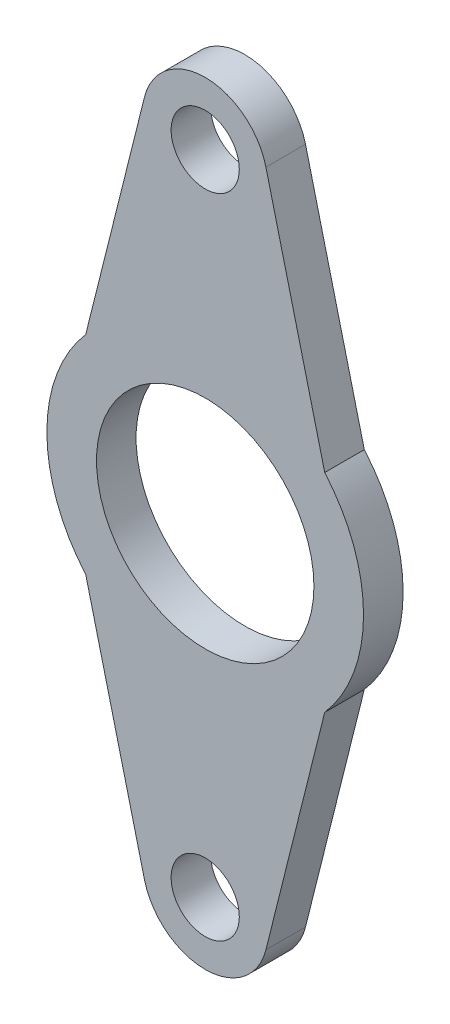
ISO-10303-21;
HEADER;
FILE_DESCRIPTION(('STEP AP214'),'2;1');
FILE_NAME('part.step','',(''),(''),'','','');
FILE_SCHEMA(('AUTOMOTIVE_DESIGN { 1 0 10303 214 1 1 1 1 }'));
ENDSEC;
DATA;
#1=APPLICATION_CONTEXT('core data for automotive mechanical design processes');
#2=APPLICATION_PROTOCOL_DEFINITION('international standard','automotive_design',2000,#1);
#3=PRODUCT_CONTEXT('',#1,'mechanical');
#4=PRODUCT('Part','Part','',(#3));
#5=PRODUCT_RELATED_PRODUCT_CATEGORY('part','',(#4));
#6=PRODUCT_DEFINITION_FORMATION('','',#4);
#7=PRODUCT_DEFINITION_CONTEXT('part definition',#1,'design');
#8=PRODUCT_DEFINITION('design','',#6,#7);
#9=PRODUCT_DEFINITION_SHAPE('','',#8);
#10=(LENGTH_UNIT() NAMED_UNIT(*) SI_UNIT(.MILLI.,.METRE.));
#11=(NAMED_UNIT(*) PLANE_ANGLE_UNIT() SI_UNIT($,.RADIAN.));
#12=(NAMED_UNIT(*) SI_UNIT($,.STERADIAN.) SOLID_ANGLE_UNIT());
#13=UNCERTAINTY_MEASURE_WITH_UNIT(LENGTH_MEASURE(1.E-05),#10,'distance_accuracy_value','');
#14=(GEOMETRIC_REPRESENTATION_CONTEXT(3) GLOBAL_UNCERTAINTY_ASSIGNED_CONTEXT((#13)) GLOBAL_UNIT_ASSIGNED_CONTEXT((#10,
#11,#12)) REPRESENTATION_CONTEXT('',''));
#15=CARTESIAN_POINT('',(0.,0.,0.));
#16=DIRECTION('',(0.,0.,1.));
#17=DIRECTION('',(1.,0.,0.));
#18=AXIS2_PLACEMENT_3D('',#15,#16,#17);
#19=CARTESIAN_POINT('',(21.9651775802428,5.49367908770032,6.35));
#20=DIRECTION('',(0.970117713261092,0.242634751049948,0.));
#21=DIRECTION('',(-0.242634751049948,0.970117713261092,0.));
#22=AXIS2_PLACEMENT_3D('',#19,#20,#21);
#23=PLANE('',#22);
#24=DIRECTION('',(0.242634751049948,-0.970117713261092,0.));
#25=VECTOR('',#24,1.);
#26=CARTESIAN_POINT('',(21.9651775802428,5.49367908770032,0.));
#27=LINE('',#26,#25);
#28=CARTESIAN_POINT('',(9.7408913265068,54.369598861778,0.));
#29=VERTEX_POINT('',#28);
#30=CARTESIAN_POINT('',(19.1721315727518,16.6610135032984,0.));
#31=VERTEX_POINT('',#30);
#32=EDGE_CURVE('E144',#29,#31,#27,.T.);
#33=ORIENTED_EDGE('',*,*,#32,.F.);
#34=DIRECTION('',(0.,0.,-1.));
#35=VECTOR('',#34,1.);
#36=CARTESIAN_POINT('',(9.7408913265068,54.369598861778,6.35));
#37=LINE('',#36,#35);
#38=CARTESIAN_POINT('',(9.7408913265068,54.369598861778,6.35));
#39=VERTEX_POINT('',#38);
#40=EDGE_CURVE('E11',#39,#29,#37,.T.);
#41=ORIENTED_EDGE('',*,*,#40,.F.);
#42=DIRECTION('',(0.242634751049948,-0.970117713261092,0.));
#43=VECTOR('',#42,1.);
#44=CARTESIAN_POINT('',(21.9651775802428,5.49367908770032,6.35));
#45=LINE('',#44,#43);
#46=CARTESIAN_POINT('',(19.1721315727518,16.6610135032984,6.35));
#47=VERTEX_POINT('',#46);
#48=EDGE_CURVE('E169',#39,#47,#45,.T.);
#49=ORIENTED_EDGE('',*,*,#48,.T.);
#50=DIRECTION('',(0.,0.,-1.));
#51=VECTOR('',#50,1.);
#52=CARTESIAN_POINT('',(19.1721315727518,16.6610135032984,6.35));
#53=LINE('',#52,#51);
#54=EDGE_CURVE('E92',#47,#31,#53,.T.);
#55=ORIENTED_EDGE('',*,*,#54,.T.);
#56=EDGE_LOOP('',(#33,#41,#49,#55));
#57=FACE_BOUND('',#56,.T.);
#58=ADVANCED_FACE('F41',(#57),#23,.T.);
#59=CARTESIAN_POINT('',(6.88062582653689E-12,51.9333184911553,6.35));
#60=DIRECTION('',(0.,0.,-1.));
#61=DIRECTION('',(-1.,0.,0.));
#62=AXIS2_PLACEMENT_3D('',#59,#60,#61);
#63=CYLINDRICAL_SURFACE('',#62,10.0409375);
#64=CARTESIAN_POINT('',(6.88062582653689E-12,51.9333184911553,0.));
#65=DIRECTION('',(0.,0.,1.));
#66=DIRECTION('',(1.,0.,0.));
#67=AXIS2_PLACEMENT_3D('',#64,#65,#66);
#68=CIRCLE('',#67,10.0409375);
#69=CARTESIAN_POINT('',(-9.74089132650032,54.3695988617763,0.));
#70=VERTEX_POINT('',#69);
#71=EDGE_CURVE('E147',#29,#70,#68,.T.);
#72=ORIENTED_EDGE('',*,*,#71,.T.);
#73=DIRECTION('',(0.,0.,-1.));
#74=VECTOR('',#73,1.);
#75=CARTESIAN_POINT('',(-9.74089132650032,54.3695988617763,6.35));
#76=LINE('',#75,#74);
#77=CARTESIAN_POINT('',(-9.74089132650032,54.3695988617763,6.35));
#78=VERTEX_POINT('',#77);
#79=EDGE_CURVE('E49',#78,#70,#76,.T.);
#80=ORIENTED_EDGE('',*,*,#79,.F.);
#81=CARTESIAN_POINT('',(6.88062582653689E-12,51.9333184911553,6.35));
#82=DIRECTION('',(0.,0.,1.));
#83=DIRECTION('',(1.,0.,0.));
#84=AXIS2_PLACEMENT_3D('',#81,#82,#83);
#85=CIRCLE('',#84,10.0409375);
#86=EDGE_CURVE('E196',#39,#78,#85,.T.);
#87=ORIENTED_EDGE('',*,*,#86,.F.);
#88=ORIENTED_EDGE('',*,*,#40,.T.);
#89=EDGE_LOOP('',(#72,#80,#87,#88));
#90=FACE_BOUND('',#89,.T.);
#91=ADVANCED_FACE('F200',(#90),#63,.T.);
#92=CARTESIAN_POINT('',(-21.9651775802428,5.49367908770032,6.35));
#93=DIRECTION('',(0.970117713261092,-0.242634751049948,0.));
#94=DIRECTION('',(0.242634751049948,0.970117713261092,0.));
#95=AXIS2_PLACEMENT_3D('',#92,#93,#94);
#96=PLANE('',#95);
#97=DIRECTION('',(-0.242634751049948,-0.970117713261092,0.));
#98=VECTOR('',#97,1.);
#99=CARTESIAN_POINT('',(-21.9651775802428,5.49367908770032,0.));
#100=LINE('',#99,#98);
#101=CARTESIAN_POINT('',(-19.1721315727518,16.6610135032984,0.));
#102=VERTEX_POINT('',#101);
#103=EDGE_CURVE('E149',#70,#102,#100,.T.);
#104=ORIENTED_EDGE('',*,*,#103,.T.);
#105=DIRECTION('',(0.,0.,-1.));
#106=VECTOR('',#105,1.);
#107=CARTESIAN_POINT('',(-19.1721315727518,16.6610135032984,6.35));
#108=LINE('',#107,#106);
#109=CARTESIAN_POINT('',(-19.1721315727518,16.6610135032984,6.35));
#110=VERTEX_POINT('',#109);
#111=EDGE_CURVE('E175',#110,#102,#108,.T.);
#112=ORIENTED_EDGE('',*,*,#111,.F.);
#113=DIRECTION('',(-0.242634751049948,-0.970117713261092,0.));
#114=VECTOR('',#113,1.);
#115=CARTESIAN_POINT('',(-21.9651775802428,5.49367908770032,6.35));
#116=LINE('',#115,#114);
#117=EDGE_CURVE('E184',#78,#110,#116,.T.);
#118=ORIENTED_EDGE('',*,*,#117,.F.);
#119=ORIENTED_EDGE('',*,*,#79,.T.);
#120=EDGE_LOOP('',(#104,#112,#118,#119));
#121=FACE_BOUND('',#120,.T.);
#122=ADVANCED_FACE('F182',(#121),#96,.F.);
#123=CARTESIAN_POINT('',(0.,0.,6.35));
#124=DIRECTION('',(0.,0.,-1.));
#125=DIRECTION('',(-1.,0.,0.));
#126=AXIS2_PLACEMENT_3D('',#123,#124,#125);
#127=CYLINDRICAL_SURFACE('',#126,25.4);
#128=CARTESIAN_POINT('',(0.,0.,0.));
#129=DIRECTION('',(0.,0.,1.));
#130=DIRECTION('',(1.,0.,0.));
#131=AXIS2_PLACEMENT_3D('',#128,#129,#130);
#132=CIRCLE('',#131,25.4);
#133=CARTESIAN_POINT('',(-19.1721315727518,-16.6610135032984,0.));
#134=VERTEX_POINT('',#133);
#135=EDGE_CURVE('E151',#102,#134,#132,.T.);
#136=ORIENTED_EDGE('',*,*,#135,.T.);
#137=DIRECTION('',(0.,0.,-1.));
#138=VECTOR('',#137,1.);
#139=CARTESIAN_POINT('',(-19.1721315727518,-16.6610135032984,6.35));
#140=LINE('',#139,#138);
#141=CARTESIAN_POINT('',(-19.1721315727518,-16.6610135032984,6.35));
#142=VERTEX_POINT('',#141);
#143=EDGE_CURVE('E173',#142,#134,#140,.T.);
#144=ORIENTED_EDGE('',*,*,#143,.F.);
#145=CARTESIAN_POINT('',(0.,0.,6.35));
#146=DIRECTION('',(0.,0.,1.));
#147=DIRECTION('',(1.,0.,0.));
#148=AXIS2_PLACEMENT_3D('',#145,#146,#147);
#149=CIRCLE('',#148,25.4);
#150=EDGE_CURVE('E133',#110,#142,#149,.T.);
#151=ORIENTED_EDGE('',*,*,#150,.F.);
#152=ORIENTED_EDGE('',*,*,#111,.T.);
#153=EDGE_LOOP('',(#136,#144,#151,#152));
#154=FACE_BOUND('',#153,.T.);
#155=ADVANCED_FACE('F194',(#154),#127,.T.);
#156=CARTESIAN_POINT('',(-21.9651775802428,-5.49367908770032,6.35));
#157=DIRECTION('',(-0.970117713261092,-0.242634751049948,0.));
#158=DIRECTION('',(0.242634751049948,-0.970117713261092,0.));
#159=AXIS2_PLACEMENT_3D('',#156,#157,#158);
#160=PLANE('',#159);
#161=DIRECTION('',(-0.242634751049948,0.970117713261092,0.));
#162=VECTOR('',#161,1.);
#163=CARTESIAN_POINT('',(-21.9651775802428,-5.49367908770032,0.));
#164=LINE('',#163,#162);
#165=CARTESIAN_POINT('',(-9.74089132650221,-54.3695988617768,0.));
#166=VERTEX_POINT('',#165);
#167=EDGE_CURVE('E154',#166,#134,#164,.T.);
#168=ORIENTED_EDGE('',*,*,#167,.F.);
#169=DIRECTION('',(0.,0.,-1.));
#170=VECTOR('',#169,1.);
#171=CARTESIAN_POINT('',(-9.74089132650221,-54.3695988617768,6.35));
#172=LINE('',#171,#170);
#173=CARTESIAN_POINT('',(-9.74089132650221,-54.3695988617768,6.35));
#174=VERTEX_POINT('',#173);
#175=EDGE_CURVE('E126',#174,#166,#172,.T.);
#176=ORIENTED_EDGE('',*,*,#175,.F.);
#177=DIRECTION('',(-0.242634751049948,0.970117713261092,0.));
#178=VECTOR('',#177,1.);
#179=CARTESIAN_POINT('',(-21.9651775802428,-5.49367908770032,6.35));
#180=LINE('',#179,#178);
#181=EDGE_CURVE('E119',#174,#142,#180,.T.);
#182=ORIENTED_EDGE('',*,*,#181,.T.);
#183=ORIENTED_EDGE('',*,*,#143,.T.);
#184=EDGE_LOOP('',(#168,#176,#182,#183));
#185=FACE_BOUND('',#184,.T.);
#186=ADVANCED_FACE('F208',(#185),#160,.T.);
#187=CARTESIAN_POINT('',(7.77431809851517E-12,-51.9333184911748,6.35));
#188=DIRECTION('',(0.,0.,-1.));
#189=DIRECTION('',(-1.,0.,0.));
#190=AXIS2_PLACEMENT_3D('',#187,#188,#189);
#191=CYLINDRICAL_SURFACE('',#190,10.0409375);
#192=CARTESIAN_POINT('',(7.77431809851517E-12,-51.9333184911748,0.));
#193=DIRECTION('',(0.,0.,1.));
#194=DIRECTION('',(1.,0.,0.));
#195=AXIS2_PLACEMENT_3D('',#192,#193,#194);
#196=CIRCLE('',#195,10.0409375);
#197=CARTESIAN_POINT('',(9.74089132650952,-54.3695988617786,0.));
#198=VERTEX_POINT('',#197);
#199=EDGE_CURVE('E125',#166,#198,#196,.T.);
#200=ORIENTED_EDGE('',*,*,#199,.T.);
#201=DIRECTION('',(0.,0.,-1.));
#202=VECTOR('',#201,1.);
#203=CARTESIAN_POINT('',(9.74089132650952,-54.3695988617786,6.35));
#204=LINE('',#203,#202);
#205=CARTESIAN_POINT('',(9.74089132650952,-54.3695988617786,6.35));
#206=VERTEX_POINT('',#205);
#207=EDGE_CURVE('E122',#206,#198,#204,.T.);
#208=ORIENTED_EDGE('',*,*,#207,.F.);
#209=CARTESIAN_POINT('',(7.77431809851517E-12,-51.9333184911748,6.35));
#210=DIRECTION('',(0.,0.,1.));
#211=DIRECTION('',(1.,0.,0.));
#212=AXIS2_PLACEMENT_3D('',#209,#210,#211);
#213=CIRCLE('',#212,10.0409375);
#214=EDGE_CURVE('E112',#174,#206,#213,.T.);
#215=ORIENTED_EDGE('',*,*,#214,.F.);
#216=ORIENTED_EDGE('',*,*,#175,.T.);
#217=EDGE_LOOP('',(#200,#208,#215,#216));
#218=FACE_BOUND('',#217,.T.);
#219=ADVANCED_FACE('F123',(#218),#191,.T.);
#220=CARTESIAN_POINT('',(21.9651775802428,-5.49367908770032,6.35));
#221=DIRECTION('',(-0.970117713261092,0.242634751049948,0.));
#222=DIRECTION('',(-0.242634751049948,-0.970117713261092,0.));
#223=AXIS2_PLACEMENT_3D('',#220,#221,#222);
#224=PLANE('',#223);
#225=DIRECTION('',(0.242634751049948,0.970117713261092,0.));
#226=VECTOR('',#225,1.);
#227=CARTESIAN_POINT('',(21.9651775802428,-5.49367908770032,0.));
#228=LINE('',#227,#226);
#229=CARTESIAN_POINT('',(19.1721315727518,-16.6610135032984,0.));
#230=VERTEX_POINT('',#229);
#231=EDGE_CURVE('E85',#198,#230,#228,.T.);
#232=ORIENTED_EDGE('',*,*,#231,.T.);
#233=DIRECTION('',(0.,0.,-1.));
#234=VECTOR('',#233,1.);
#235=CARTESIAN_POINT('',(19.1721315727518,-16.6610135032984,6.35));
#236=LINE('',#235,#234);
#237=CARTESIAN_POINT('',(19.1721315727518,-16.6610135032984,6.35));
#238=VERTEX_POINT('',#237);
#239=EDGE_CURVE('E127',#238,#230,#236,.T.);
#240=ORIENTED_EDGE('',*,*,#239,.F.);
#241=DIRECTION('',(0.242634751049948,0.970117713261092,0.));
#242=VECTOR('',#241,1.);
#243=CARTESIAN_POINT('',(21.9651775802428,-5.49367908770032,6.35));
#244=LINE('',#243,#242);
#245=EDGE_CURVE('E117',#206,#238,#244,.T.);
#246=ORIENTED_EDGE('',*,*,#245,.F.);
#247=ORIENTED_EDGE('',*,*,#207,.T.);
#248=EDGE_LOOP('',(#232,#240,#246,#247));
#249=FACE_BOUND('',#248,.T.);
#250=ADVANCED_FACE('F129',(#249),#224,.F.);
#251=CARTESIAN_POINT('',(6.88062582653689E-12,51.9333184911553,6.35));
#252=DIRECTION('',(0.,0.,-1.));
#253=DIRECTION('',(-1.,0.,0.));
#254=AXIS2_PLACEMENT_3D('',#251,#252,#253);
#255=CYLINDRICAL_SURFACE('',#254,5.4689375);
#256=CARTESIAN_POINT('',(6.88062582653689E-12,51.9333184911553,6.35));
#257=DIRECTION('',(0.,0.,1.));
#258=DIRECTION('',(1.,0.,0.));
#259=AXIS2_PLACEMENT_3D('',#256,#257,#258);
#260=CIRCLE('',#259,5.4689375);
#261=CARTESIAN_POINT('',(5.46893750000689,51.9333184911553,6.35));
#262=VERTEX_POINT('',#261);
#263=EDGE_CURVE('E138',#262,#262,#260,.T.);
#264=ORIENTED_EDGE('',*,*,#263,.T.);
#265=EDGE_LOOP('',(#264));
#266=FACE_BOUND('',#265,.T.);
#267=CARTESIAN_POINT('',(6.88062582653689E-12,51.9333184911553,0.));
#268=DIRECTION('',(0.,0.,1.));
#269=DIRECTION('',(1.,0.,0.));
#270=AXIS2_PLACEMENT_3D('',#267,#268,#269);
#271=CIRCLE('',#270,5.4689375);
#272=CARTESIAN_POINT('',(5.46893750000689,51.9333184911553,0.));
#273=VERTEX_POINT('',#272);
#274=EDGE_CURVE('E163',#273,#273,#271,.T.);
#275=ORIENTED_EDGE('',*,*,#274,.F.);
#276=EDGE_LOOP('',(#275));
#277=FACE_BOUND('',#276,.T.);
#278=ADVANCED_FACE('F216',(#266,#277),#255,.F.);
#279=CARTESIAN_POINT('',(0.,0.,6.35));
#280=DIRECTION('',(0.,0.,-1.));
#281=DIRECTION('',(-1.,0.,0.));
#282=AXIS2_PLACEMENT_3D('',#279,#280,#281);
#283=CYLINDRICAL_SURFACE('',#282,17.4419578632748);
#284=CARTESIAN_POINT('',(0.,0.,6.35));
#285=DIRECTION('',(0.,0.,1.));
#286=DIRECTION('',(1.,0.,0.));
#287=AXIS2_PLACEMENT_3D('',#284,#285,#286);
#288=CIRCLE('',#287,17.4419578632748);
#289=CARTESIAN_POINT('',(17.4419578632748,0.,6.35));
#290=VERTEX_POINT('',#289);
#291=EDGE_CURVE('E131',#290,#290,#288,.T.);
#292=ORIENTED_EDGE('',*,*,#291,.T.);
#293=EDGE_LOOP('',(#292));
#294=FACE_BOUND('',#293,.T.);
#295=CARTESIAN_POINT('',(0.,0.,0.));
#296=DIRECTION('',(0.,0.,1.));
#297=DIRECTION('',(1.,0.,0.));
#298=AXIS2_PLACEMENT_3D('',#295,#296,#297);
#299=CIRCLE('',#298,17.4419578632748);
#300=CARTESIAN_POINT('',(17.4419578632748,0.,0.));
#301=VERTEX_POINT('',#300);
#302=EDGE_CURVE('E160',#301,#301,#299,.T.);
#303=ORIENTED_EDGE('',*,*,#302,.F.);
#304=EDGE_LOOP('',(#303));
#305=FACE_BOUND('',#304,.T.);
#306=ADVANCED_FACE('F221',(#294,#305),#283,.F.);
#307=EDGE_CURVE('E155',#230,#31,#132,.T.);
#308=ORIENTED_EDGE('',*,*,#307,.T.);
#309=ORIENTED_EDGE('',*,*,#54,.F.);
#310=EDGE_CURVE('E57',#238,#47,#149,.T.);
#311=ORIENTED_EDGE('',*,*,#310,.F.);
#312=ORIENTED_EDGE('',*,*,#239,.T.);
#313=EDGE_LOOP('',(#308,#309,#311,#312));
#314=FACE_BOUND('',#313,.T.);
#315=ADVANCED_FACE('F217',(#314),#127,.T.);
#316=CARTESIAN_POINT('',(7.77431809851517E-12,-51.9333184911748,6.35));
#317=DIRECTION('',(0.,0.,-1.));
#318=DIRECTION('',(-1.,0.,0.));
#319=AXIS2_PLACEMENT_3D('',#316,#317,#318);
#320=CYLINDRICAL_SURFACE('',#319,5.4689375);
#321=CARTESIAN_POINT('',(7.77431809851517E-12,-51.9333184911748,6.35));
#322=DIRECTION('',(0.,0.,1.));
#323=DIRECTION('',(1.,0.,0.));
#324=AXIS2_PLACEMENT_3D('',#321,#322,#323);
#325=CIRCLE('',#324,5.4689375);
#326=CARTESIAN_POINT('',(5.46893750000778,-51.9333184911748,6.35));
#327=VERTEX_POINT('',#326);
#328=EDGE_CURVE('E141',#327,#327,#325,.T.);
#329=ORIENTED_EDGE('',*,*,#328,.T.);
#330=EDGE_LOOP('',(#329));
#331=FACE_BOUND('',#330,.T.);
#332=CARTESIAN_POINT('',(7.77431809851517E-12,-51.9333184911748,0.));
#333=DIRECTION('',(0.,0.,1.));
#334=DIRECTION('',(1.,0.,0.));
#335=AXIS2_PLACEMENT_3D('',#332,#333,#334);
#336=CIRCLE('',#335,5.4689375);
#337=CARTESIAN_POINT('',(5.46893750000778,-51.9333184911748,0.));
#338=VERTEX_POINT('',#337);
#339=EDGE_CURVE('E166',#338,#338,#336,.T.);
#340=ORIENTED_EDGE('',*,*,#339,.F.);
#341=EDGE_LOOP('',(#340));
#342=FACE_BOUND('',#341,.T.);
#343=ADVANCED_FACE('F220',(#331,#342),#320,.F.);
#344=CARTESIAN_POINT('',(0.,0.,6.35));
#345=DIRECTION('',(0.,0.,1.));
#346=DIRECTION('',(1.,0.,0.));
#347=AXIS2_PLACEMENT_3D('',#344,#345,#346);
#348=PLANE('',#347);
#349=ORIENTED_EDGE('',*,*,#48,.F.);
#350=ORIENTED_EDGE('',*,*,#86,.T.);
#351=ORIENTED_EDGE('',*,*,#117,.T.);
#352=ORIENTED_EDGE('',*,*,#150,.T.);
#353=ORIENTED_EDGE('',*,*,#181,.F.);
#354=ORIENTED_EDGE('',*,*,#214,.T.);
#355=ORIENTED_EDGE('',*,*,#245,.T.);
#356=ORIENTED_EDGE('',*,*,#310,.T.);
#357=EDGE_LOOP('',(#349,#350,#351,#352,#353,#354,#355,#356));
#358=FACE_BOUND('',#357,.T.);
#359=ORIENTED_EDGE('',*,*,#291,.F.);
#360=EDGE_LOOP('',(#359));
#361=FACE_BOUND('',#360,.T.);
#362=ORIENTED_EDGE('',*,*,#263,.F.);
#363=EDGE_LOOP('',(#362));
#364=FACE_BOUND('',#363,.T.);
#365=ORIENTED_EDGE('',*,*,#328,.F.);
#366=EDGE_LOOP('',(#365));
#367=FACE_BOUND('',#366,.T.);
#368=ADVANCED_FACE('F114',(#358,#361,#364,#367),#348,.T.);
#369=CARTESIAN_POINT('',(0.,0.,0.));
#370=DIRECTION('',(0.,0.,1.));
#371=DIRECTION('',(1.,0.,0.));
#372=AXIS2_PLACEMENT_3D('',#369,#370,#371);
#373=PLANE('',#372);
#374=ORIENTED_EDGE('',*,*,#32,.T.);
#375=ORIENTED_EDGE('',*,*,#307,.F.);
#376=ORIENTED_EDGE('',*,*,#231,.F.);
#377=ORIENTED_EDGE('',*,*,#199,.F.);
#378=ORIENTED_EDGE('',*,*,#167,.T.);
#379=ORIENTED_EDGE('',*,*,#135,.F.);
#380=ORIENTED_EDGE('',*,*,#103,.F.);
#381=ORIENTED_EDGE('',*,*,#71,.F.);
#382=EDGE_LOOP('',(#374,#375,#376,#377,#378,#379,#380,#381));
#383=FACE_BOUND('',#382,.T.);
#384=ORIENTED_EDGE('',*,*,#302,.T.);
#385=EDGE_LOOP('',(#384));
#386=FACE_BOUND('',#385,.T.);
#387=ORIENTED_EDGE('',*,*,#274,.T.);
#388=EDGE_LOOP('',(#387));
#389=FACE_BOUND('',#388,.T.);
#390=ORIENTED_EDGE('',*,*,#339,.T.);
#391=EDGE_LOOP('',(#390));
#392=FACE_BOUND('',#391,.T.);
#393=ADVANCED_FACE('F189',(#383,#386,#389,#392),#373,.F.);
#394=CLOSED_SHELL('',(#58,#91,#122,#155,#186,#219,#250,#278,#306,#315,#343,#368,#393));
#395=MANIFOLD_SOLID_BREP('B2',#394);
#396=ADVANCED_BREP_SHAPE_REPRESENTATION('',(#18,#395),#14);
#397=SHAPE_DEFINITION_REPRESENTATION(#9,#396);
ENDSEC;
END-ISO-10303-21;
